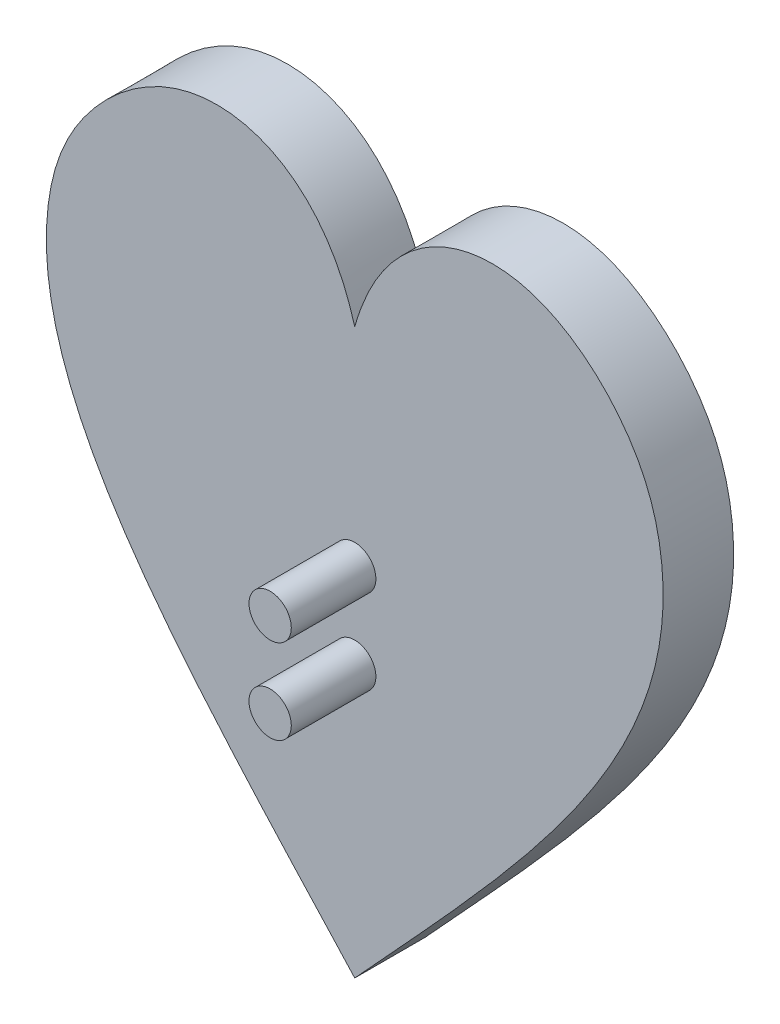
ISO-10303-21;
HEADER;
FILE_DESCRIPTION(('STEP AP214'),'2;1');
FILE_NAME('part.step','',(''),(''),'','','');
FILE_SCHEMA(('AUTOMOTIVE_DESIGN { 1 0 10303 214 1 1 1 1 }'));
ENDSEC;
DATA;
#1=APPLICATION_CONTEXT('core data for automotive mechanical design processes');
#2=APPLICATION_PROTOCOL_DEFINITION('international standard','automotive_design',2000,#1);
#3=PRODUCT_CONTEXT('',#1,'mechanical');
#4=PRODUCT('Part','Part','',(#3));
#5=PRODUCT_RELATED_PRODUCT_CATEGORY('part','',(#4));
#6=PRODUCT_DEFINITION_FORMATION('','',#4);
#7=PRODUCT_DEFINITION_CONTEXT('part definition',#1,'design');
#8=PRODUCT_DEFINITION('design','',#6,#7);
#9=PRODUCT_DEFINITION_SHAPE('','',#8);
#10=(LENGTH_UNIT() NAMED_UNIT(*) SI_UNIT(.MILLI.,.METRE.));
#11=(NAMED_UNIT(*) PLANE_ANGLE_UNIT() SI_UNIT($,.RADIAN.));
#12=(NAMED_UNIT(*) SI_UNIT($,.STERADIAN.) SOLID_ANGLE_UNIT());
#13=UNCERTAINTY_MEASURE_WITH_UNIT(LENGTH_MEASURE(1.E-05),#10,'distance_accuracy_value','');
#14=(GEOMETRIC_REPRESENTATION_CONTEXT(3) GLOBAL_UNCERTAINTY_ASSIGNED_CONTEXT((#13)) GLOBAL_UNIT_ASSIGNED_CONTEXT((#10,
#11,#12)) REPRESENTATION_CONTEXT('',''));
#15=CARTESIAN_POINT('',(0.,0.,0.));
#16=DIRECTION('',(0.,0.,1.));
#17=DIRECTION('',(1.,0.,0.));
#18=AXIS2_PLACEMENT_3D('',#15,#16,#17);
#19=CARTESIAN_POINT('',(1.65459425492531,28.6370867306256,6.35));
#20=CARTESIAN_POINT('',(-0.961688106243552,37.9946195022359,6.35));
#21=CARTESIAN_POINT('',(-12.9710461486688,43.2489042341502,6.35));
#22=CARTESIAN_POINT('',(-24.2467739737521,32.3523533035111,6.35));
#23=CARTESIAN_POINT('',(-29.5892853584684,10.5783367401737,6.35));
#24=CARTESIAN_POINT('',(-13.3475472086324,-5.77912261948601,6.35));
#25=CARTESIAN_POINT('',(1.65459425492536,-22.1629132693744,6.35));
#26=B_SPLINE_CURVE_WITH_KNOTS('',3,(#19,#20,#21,#22,#23,#24,#25),.UNSPECIFIED.,.F.,.F.,(4,1,1,1,
4),(0.,0.212199078159572,0.359774348786122,0.438554440970164,1.),.UNSPECIFIED.);
#27=DIRECTION('',(0.,0.,-1.));
#28=VECTOR('',#27,1.);
#29=SURFACE_OF_LINEAR_EXTRUSION('',#26,#28);
#30=CARTESIAN_POINT('',(1.65459425492531,28.6370867306256,0.));
#31=CARTESIAN_POINT('',(-0.961688106243552,37.9946195022359,0.));
#32=CARTESIAN_POINT('',(-12.9710461486688,43.2489042341502,0.));
#33=CARTESIAN_POINT('',(-24.2467739737521,32.3523533035111,0.));
#34=CARTESIAN_POINT('',(-29.5892853584684,10.5783367401737,0.));
#35=CARTESIAN_POINT('',(-13.3475472086324,-5.77912261948601,0.));
#36=CARTESIAN_POINT('',(1.65459425492536,-22.1629132693744,0.));
#37=B_SPLINE_CURVE_WITH_KNOTS('',3,(#30,#31,#32,#33,#34,#35,#36),.UNSPECIFIED.,.F.,.F.,(4,1,1,1,
4),(0.,0.212199078159572,0.359774348786122,0.438554440970164,1.),.UNSPECIFIED.);
#38=CARTESIAN_POINT('',(1.65459425492531,28.6370867306256,0.));
#39=VERTEX_POINT('',#38);
#40=CARTESIAN_POINT('',(1.65459425492527,-22.1629132693744,0.));
#41=VERTEX_POINT('',#40);
#42=EDGE_CURVE('E70',#39,#41,#37,.T.);
#43=ORIENTED_EDGE('',*,*,#42,.T.);
#44=DIRECTION('',(0.,0.,-1.));
#45=VECTOR('',#44,1.);
#46=CARTESIAN_POINT('',(1.65459425492527,-22.1629132693744,6.35));
#47=LINE('',#46,#45);
#48=CARTESIAN_POINT('',(1.65459425492527,-22.1629132693744,6.35));
#49=VERTEX_POINT('',#48);
#50=EDGE_CURVE('E67',#49,#41,#47,.T.);
#51=ORIENTED_EDGE('',*,*,#50,.F.);
#52=CARTESIAN_POINT('',(1.65459425492531,28.6370867306256,6.35));
#53=VERTEX_POINT('',#52);
#54=EDGE_CURVE('E69',#53,#49,#26,.T.);
#55=ORIENTED_EDGE('',*,*,#54,.F.);
#56=DIRECTION('',(0.,0.,-1.));
#57=VECTOR('',#56,1.);
#58=CARTESIAN_POINT('',(1.65459425492531,28.6370867306256,6.35));
#59=LINE('',#58,#57);
#60=EDGE_CURVE('E64',#53,#39,#59,.T.);
#61=ORIENTED_EDGE('',*,*,#60,.T.);
#62=EDGE_LOOP('',(#43,#51,#55,#61));
#63=FACE_BOUND('',#62,.T.);
#64=ADVANCED_FACE('F35',(#63),#29,.F.);
#65=CARTESIAN_POINT('',(1.65459425492527,-22.1629132693744,6.35));
#66=CARTESIAN_POINT('',(16.656735718483,-5.779122619486,6.35));
#67=CARTESIAN_POINT('',(32.898473868319,10.5783367401738,6.35));
#68=CARTESIAN_POINT('',(27.5559624836027,32.3523533035111,6.35));
#69=CARTESIAN_POINT('',(16.2802346585194,43.2489042341502,6.35));
#70=CARTESIAN_POINT('',(4.27087661609416,37.9946195022359,6.35));
#71=CARTESIAN_POINT('',(1.65459425492531,28.6370867306256,6.35));
#72=B_SPLINE_CURVE_WITH_KNOTS('',3,(#65,#66,#67,#68,#69,#70,#71),.UNSPECIFIED.,.F.,.F.,(4,1,1,1,
4),(0.,0.561445559029836,0.640225651213878,0.787800921840428,1.),.UNSPECIFIED.);
#73=DIRECTION('',(0.,0.,-1.));
#74=VECTOR('',#73,1.);
#75=SURFACE_OF_LINEAR_EXTRUSION('',#72,#74);
#76=CARTESIAN_POINT('',(1.65459425492527,-22.1629132693744,0.));
#77=CARTESIAN_POINT('',(16.656735718483,-5.779122619486,0.));
#78=CARTESIAN_POINT('',(32.898473868319,10.5783367401738,0.));
#79=CARTESIAN_POINT('',(27.5559624836027,32.3523533035111,0.));
#80=CARTESIAN_POINT('',(16.2802346585194,43.2489042341502,0.));
#81=CARTESIAN_POINT('',(4.27087661609416,37.9946195022359,0.));
#82=CARTESIAN_POINT('',(1.65459425492531,28.6370867306256,0.));
#83=B_SPLINE_CURVE_WITH_KNOTS('',3,(#76,#77,#78,#79,#80,#81,#82),.UNSPECIFIED.,.F.,.F.,(4,1,1,1,
4),(0.,0.561445559029836,0.640225651213878,0.787800921840428,1.),.UNSPECIFIED.);
#84=EDGE_CURVE('E59',#41,#39,#83,.T.);
#85=ORIENTED_EDGE('',*,*,#84,.T.);
#86=ORIENTED_EDGE('',*,*,#60,.F.);
#87=EDGE_CURVE('E51',#49,#53,#72,.T.);
#88=ORIENTED_EDGE('',*,*,#87,.F.);
#89=ORIENTED_EDGE('',*,*,#50,.T.);
#90=EDGE_LOOP('',(#85,#86,#88,#89));
#91=FACE_BOUND('',#90,.T.);
#92=ADVANCED_FACE('F63',(#91),#75,.F.);
#93=CARTESIAN_POINT('',(-25.9761956543449,18.9244355447482,6.35));
#94=DIRECTION('',(0.,0.,-1.));
#95=DIRECTION('',(-1.,0.,0.));
#96=AXIS2_PLACEMENT_3D('',#93,#94,#95);
#97=PLANE('',#96);
#98=CARTESIAN_POINT('',(1.65459425492529,2.29610963692142,6.35));
#99=DIRECTION('',(0.,0.,-1.));
#100=DIRECTION('',(-1.,0.,0.));
#101=AXIS2_PLACEMENT_3D('',#98,#99,#100);
#102=CIRCLE('',#101,1.905);
#103=CARTESIAN_POINT('',(-0.250405745074715,2.29610963692142,6.35));
#104=VERTEX_POINT('',#103);
#105=EDGE_CURVE('E11',#104,#104,#102,.F.);
#106=ORIENTED_EDGE('',*,*,#105,.F.);
#107=EDGE_LOOP('',(#106));
#108=FACE_BOUND('',#107,.T.);
#109=CARTESIAN_POINT('',(1.65459425492531,9.91610963692142,6.35));
#110=DIRECTION('',(0.,0.,-1.));
#111=DIRECTION('',(-1.,0.,0.));
#112=AXIS2_PLACEMENT_3D('',#109,#110,#111);
#113=CIRCLE('',#112,1.905);
#114=CARTESIAN_POINT('',(-0.250405745074692,9.91610963692142,6.35));
#115=VERTEX_POINT('',#114);
#116=EDGE_CURVE('E44',#115,#115,#113,.F.);
#117=ORIENTED_EDGE('',*,*,#116,.F.);
#118=EDGE_LOOP('',(#117));
#119=FACE_BOUND('',#118,.T.);
#120=ORIENTED_EDGE('',*,*,#54,.T.);
#121=ORIENTED_EDGE('',*,*,#87,.T.);
#122=EDGE_LOOP('',(#120,#121));
#123=FACE_BOUND('',#122,.T.);
#124=ADVANCED_FACE('F100',(#108,#119,#123),#97,.F.);
#125=CARTESIAN_POINT('',(-25.9761956543449,18.9244355447482,0.));
#126=DIRECTION('',(0.,0.,-1.));
#127=DIRECTION('',(-1.,0.,0.));
#128=AXIS2_PLACEMENT_3D('',#125,#126,#127);
#129=PLANE('',#128);
#130=ORIENTED_EDGE('',*,*,#42,.F.);
#131=ORIENTED_EDGE('',*,*,#84,.F.);
#132=EDGE_LOOP('',(#130,#131));
#133=FACE_BOUND('',#132,.T.);
#134=ADVANCED_FACE('F74',(#133),#129,.T.);
#135=CARTESIAN_POINT('',(1.65459425492531,9.91610963692142,13.97));
#136=DIRECTION('',(0.,0.,-1.));
#137=DIRECTION('',(-1.,0.,0.));
#138=AXIS2_PLACEMENT_3D('',#135,#136,#137);
#139=CYLINDRICAL_SURFACE('',#138,1.905);
#140=CARTESIAN_POINT('',(1.65459425492531,9.91610963692142,13.97));
#141=DIRECTION('',(0.,0.,1.));
#142=DIRECTION('',(1.,0.,0.));
#143=AXIS2_PLACEMENT_3D('',#140,#141,#142);
#144=CIRCLE('',#143,1.905);
#145=CARTESIAN_POINT('',(3.55959425492531,9.91610963692142,13.97));
#146=VERTEX_POINT('',#145);
#147=EDGE_CURVE('E75',#146,#146,#144,.T.);
#148=ORIENTED_EDGE('',*,*,#147,.F.);
#149=EDGE_LOOP('',(#148));
#150=FACE_BOUND('',#149,.T.);
#151=ORIENTED_EDGE('',*,*,#116,.T.);
#152=EDGE_LOOP('',(#151));
#153=FACE_BOUND('',#152,.T.);
#154=ADVANCED_FACE('F98',(#150,#153),#139,.T.);
#155=CARTESIAN_POINT('',(1.65459425492531,9.91610963692142,13.97));
#156=DIRECTION('',(0.,0.,1.));
#157=DIRECTION('',(1.,0.,0.));
#158=AXIS2_PLACEMENT_3D('',#155,#156,#157);
#159=PLANE('',#158);
#160=ORIENTED_EDGE('',*,*,#147,.T.);
#161=EDGE_LOOP('',(#160));
#162=FACE_BOUND('',#161,.T.);
#163=ADVANCED_FACE('F119',(#162),#159,.T.);
#164=CARTESIAN_POINT('',(1.65459425492529,2.29610963692142,13.97));
#165=DIRECTION('',(0.,0.,-1.));
#166=DIRECTION('',(-1.,0.,0.));
#167=AXIS2_PLACEMENT_3D('',#164,#165,#166);
#168=CYLINDRICAL_SURFACE('',#167,1.905);
#169=CARTESIAN_POINT('',(1.65459425492529,2.29610963692142,13.97));
#170=DIRECTION('',(0.,0.,1.));
#171=DIRECTION('',(1.,0.,0.));
#172=AXIS2_PLACEMENT_3D('',#169,#170,#171);
#173=CIRCLE('',#172,1.905);
#174=CARTESIAN_POINT('',(3.55959425492529,2.29610963692142,13.97));
#175=VERTEX_POINT('',#174);
#176=EDGE_CURVE('E78',#175,#175,#173,.T.);
#177=ORIENTED_EDGE('',*,*,#176,.F.);
#178=EDGE_LOOP('',(#177));
#179=FACE_BOUND('',#178,.T.);
#180=ORIENTED_EDGE('',*,*,#105,.T.);
#181=EDGE_LOOP('',(#180));
#182=FACE_BOUND('',#181,.T.);
#183=ADVANCED_FACE('F116',(#179,#182),#168,.T.);
#184=CARTESIAN_POINT('',(1.65459425492529,2.29610963692142,13.97));
#185=DIRECTION('',(0.,0.,1.));
#186=DIRECTION('',(1.,0.,0.));
#187=AXIS2_PLACEMENT_3D('',#184,#185,#186);
#188=PLANE('',#187);
#189=ORIENTED_EDGE('',*,*,#176,.T.);
#190=EDGE_LOOP('',(#189));
#191=FACE_BOUND('',#190,.T.);
#192=ADVANCED_FACE('F114',(#191),#188,.T.);
#193=CLOSED_SHELL('',(#64,#92,#124,#134,#154,#163,#183,#192));
#194=MANIFOLD_SOLID_BREP('B2',#193);
#195=ADVANCED_BREP_SHAPE_REPRESENTATION('',(#18,#194),#14);
#196=SHAPE_DEFINITION_REPRESENTATION(#9,#195);
ENDSEC;
END-ISO-10303-21;
